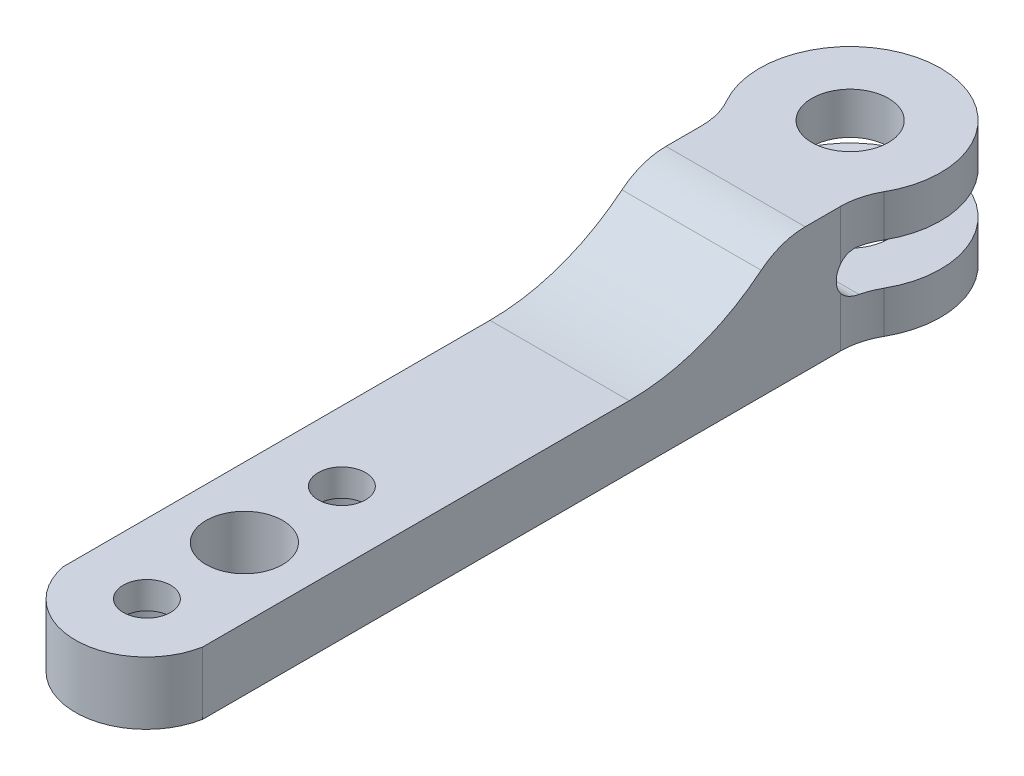
ISO-10303-21;
HEADER;
FILE_DESCRIPTION(('STEP AP214'),'2;1');
FILE_NAME('part.step','',(''),(''),'','','');
FILE_SCHEMA(('AUTOMOTIVE_DESIGN { 1 0 10303 214 1 1 1 1 }'));
ENDSEC;
DATA;
#1=APPLICATION_CONTEXT('core data for automotive mechanical design processes');
#2=APPLICATION_PROTOCOL_DEFINITION('international standard','automotive_design',2000,#1);
#3=PRODUCT_CONTEXT('',#1,'mechanical');
#4=PRODUCT('Part','Part','',(#3));
#5=PRODUCT_RELATED_PRODUCT_CATEGORY('part','',(#4));
#6=PRODUCT_DEFINITION_FORMATION('','',#4);
#7=PRODUCT_DEFINITION_CONTEXT('part definition',#1,'design');
#8=PRODUCT_DEFINITION('design','',#6,#7);
#9=PRODUCT_DEFINITION_SHAPE('','',#8);
#10=(LENGTH_UNIT() NAMED_UNIT(*) SI_UNIT(.MILLI.,.METRE.));
#11=(NAMED_UNIT(*) PLANE_ANGLE_UNIT() SI_UNIT($,.RADIAN.));
#12=(NAMED_UNIT(*) SI_UNIT($,.STERADIAN.) SOLID_ANGLE_UNIT());
#13=UNCERTAINTY_MEASURE_WITH_UNIT(LENGTH_MEASURE(1.E-05),#10,'distance_accuracy_value','');
#14=(GEOMETRIC_REPRESENTATION_CONTEXT(3) GLOBAL_UNCERTAINTY_ASSIGNED_CONTEXT((#13)) GLOBAL_UNIT_ASSIGNED_CONTEXT((#10,
#11,#12)) REPRESENTATION_CONTEXT('',''));
#15=CARTESIAN_POINT('',(0.,0.,0.));
#16=DIRECTION('',(0.,0.,1.));
#17=DIRECTION('',(1.,0.,0.));
#18=AXIS2_PLACEMENT_3D('',#15,#16,#17);
#19=CARTESIAN_POINT('',(0.,9.,-21.75));
#20=DIRECTION('',(0.,-1.,0.));
#21=DIRECTION('',(0.,0.,-1.));
#22=AXIS2_PLACEMENT_3D('',#19,#20,#21);
#23=CYLINDRICAL_SURFACE('',#22,6.5);
#24=CARTESIAN_POINT('',(0.,9.,-21.75));
#25=DIRECTION('',(0.,1.,0.));
#26=DIRECTION('',(0.,0.,1.));
#27=AXIS2_PLACEMENT_3D('',#24,#25,#26);
#28=CIRCLE('',#27,6.5);
#29=CARTESIAN_POINT('',(5.65217391304348,9.,-18.5401822393303));
#30=VERTEX_POINT('',#29);
#31=CARTESIAN_POINT('',(-5.65217391304348,9.,-18.5401822393303));
#32=VERTEX_POINT('',#31);
#33=EDGE_CURVE('E208',#30,#32,#28,.T.);
#34=ORIENTED_EDGE('',*,*,#33,.F.);
#35=DIRECTION('',(0.,-1.,0.));
#36=VECTOR('',#35,1.);
#37=CARTESIAN_POINT('',(5.65217391304348,9.,-18.5401822393303));
#38=LINE('',#37,#36);
#39=CARTESIAN_POINT('',(5.65217391304348,6.,-18.5401822393303));
#40=VERTEX_POINT('',#39);
#41=EDGE_CURVE('E284',#30,#40,#38,.T.);
#42=ORIENTED_EDGE('',*,*,#41,.T.);
#43=CARTESIAN_POINT('',(0.,6.,-21.75));
#44=DIRECTION('',(0.,-1.,0.));
#45=DIRECTION('',(0.,0.,-1.));
#46=AXIS2_PLACEMENT_3D('',#43,#44,#45);
#47=CIRCLE('',#46,6.5);
#48=CARTESIAN_POINT('',(-5.65217391304348,6.,-18.5401822393303));
#49=VERTEX_POINT('',#48);
#50=EDGE_CURVE('E357',#40,#49,#47,.F.);
#51=ORIENTED_EDGE('',*,*,#50,.T.);
#52=DIRECTION('',(0.,-1.,0.));
#53=VECTOR('',#52,1.);
#54=CARTESIAN_POINT('',(-5.65217391304348,9.,-18.5401822393303));
#55=LINE('',#54,#53);
#56=EDGE_CURVE('E281',#49,#32,#55,.F.);
#57=ORIENTED_EDGE('',*,*,#56,.T.);
#58=EDGE_LOOP('',(#34,#42,#51,#57));
#59=FACE_BOUND('',#58,.T.);
#60=ADVANCED_FACE('F53',(#59),#23,.T.);
#61=CARTESIAN_POINT('',(0.,9.,-21.75));
#62=DIRECTION('',(0.,-1.,0.));
#63=DIRECTION('',(0.,0.,-1.));
#64=AXIS2_PLACEMENT_3D('',#61,#62,#63);
#65=CYLINDRICAL_SURFACE('',#64,2.75);
#66=CARTESIAN_POINT('',(0.,9.,-21.75));
#67=DIRECTION('',(0.,-1.,0.));
#68=DIRECTION('',(0.,0.,-1.));
#69=AXIS2_PLACEMENT_3D('',#66,#67,#68);
#70=CIRCLE('',#69,2.75);
#71=CARTESIAN_POINT('',(0.,9.,-24.5));
#72=VERTEX_POINT('',#71);
#73=EDGE_CURVE('E199',#72,#72,#70,.T.);
#74=ORIENTED_EDGE('',*,*,#73,.F.);
#75=EDGE_LOOP('',(#74));
#76=FACE_BOUND('',#75,.T.);
#77=CARTESIAN_POINT('',(0.,6.,-21.75));
#78=DIRECTION('',(0.,-1.,0.));
#79=DIRECTION('',(0.,0.,-1.));
#80=AXIS2_PLACEMENT_3D('',#77,#78,#79);
#81=CIRCLE('',#80,2.75);
#82=CARTESIAN_POINT('',(0.,6.,-24.5));
#83=VERTEX_POINT('',#82);
#84=EDGE_CURVE('E403',#83,#83,#81,.T.);
#85=ORIENTED_EDGE('',*,*,#84,.T.);
#86=EDGE_LOOP('',(#85));
#87=FACE_BOUND('',#86,.T.);
#88=ADVANCED_FACE('F478',(#76,#87),#65,.F.);
#89=CARTESIAN_POINT('',(-5.,4.5,21.75));
#90=DIRECTION('',(1.,0.,0.));
#91=DIRECTION('',(0.,0.,-1.));
#92=AXIS2_PLACEMENT_3D('',#89,#90,#91);
#93=PLANE('',#92);
#94=CARTESIAN_POINT('',(-5.,19.5,-0.884545425726689));
#95=DIRECTION('',(1.,0.,0.));
#96=DIRECTION('',(0.,0.,-1.));
#97=AXIS2_PLACEMENT_3D('',#94,#95,#96);
#98=CIRCLE('',#97,15.);
#99=CARTESIAN_POINT('',(-5.,4.5,-0.884545425726687));
#100=VERTEX_POINT('',#99);
#101=CARTESIAN_POINT('',(-5.,7.875,-10.3639639205501));
#102=VERTEX_POINT('',#101);
#103=EDGE_CURVE('E241',#100,#102,#98,.T.);
#104=ORIENTED_EDGE('',*,*,#103,.T.);
#105=CARTESIAN_POINT('',(-5.,4.,-13.5237700854912));
#106=DIRECTION('',(1.,0.,0.));
#107=DIRECTION('',(0.,0.,-1.));
#108=AXIS2_PLACEMENT_3D('',#105,#106,#107);
#109=CIRCLE('',#108,5.);
#110=CARTESIAN_POINT('',(-5.,9.,-13.5237700854912));
#111=VERTEX_POINT('',#110);
#112=EDGE_CURVE('E271',#102,#111,#109,.F.);
#113=ORIENTED_EDGE('',*,*,#112,.T.);
#114=DIRECTION('',(0.,0.,1.));
#115=VECTOR('',#114,1.);
#116=CARTESIAN_POINT('',(-5.,9.,-17.596688068541));
#117=LINE('',#116,#115);
#118=CARTESIAN_POINT('',(-5.,9.,-16.0710916541997));
#119=VERTEX_POINT('',#118);
#120=EDGE_CURVE('E212',#119,#111,#117,.T.);
#121=ORIENTED_EDGE('',*,*,#120,.F.);
#122=DIRECTION('',(0.,1.,0.));
#123=VECTOR('',#122,1.);
#124=CARTESIAN_POINT('',(-5.,6.,-16.0710916541997));
#125=LINE('',#124,#123);
#126=CARTESIAN_POINT('',(-5.,5.42745625891599,-16.0710916541997));
#127=VERTEX_POINT('',#126);
#128=EDGE_CURVE('E263',#119,#127,#125,.F.);
#129=ORIENTED_EDGE('',*,*,#128,.T.);
#130=CARTESIAN_POINT('',(-5.,4.50000000000001,-17.25));
#131=DIRECTION('',(1.,0.,0.));
#132=DIRECTION('',(0.,0.,-1.));
#133=AXIS2_PLACEMENT_3D('',#130,#131,#132);
#134=CIRCLE('',#133,1.5);
#135=CARTESIAN_POINT('',(-5.,3.57254374108402,-16.0710916541997));
#136=VERTEX_POINT('',#135);
#137=EDGE_CURVE('E411',#136,#127,#134,.F.);
#138=ORIENTED_EDGE('',*,*,#137,.F.);
#139=DIRECTION('',(0.,1.,0.));
#140=VECTOR('',#139,1.);
#141=CARTESIAN_POINT('',(-5.,0.,-16.0710916541997));
#142=LINE('',#141,#140);
#143=CARTESIAN_POINT('',(-5.,0.,-16.0710916541997));
#144=VERTEX_POINT('',#143);
#145=EDGE_CURVE('E267',#136,#144,#142,.F.);
#146=ORIENTED_EDGE('',*,*,#145,.T.);
#147=DIRECTION('',(0.,0.,1.));
#148=VECTOR('',#147,1.);
#149=CARTESIAN_POINT('',(-5.,0.,21.75));
#150=LINE('',#149,#148);
#151=CARTESIAN_POINT('',(-5.,0.,29.75));
#152=VERTEX_POINT('',#151);
#153=EDGE_CURVE('E228',#144,#152,#150,.T.);
#154=ORIENTED_EDGE('',*,*,#153,.T.);
#155=DIRECTION('',(0.,-1.,0.));
#156=VECTOR('',#155,1.);
#157=CARTESIAN_POINT('',(-5.,20.2261972553421,29.75));
#158=LINE('',#157,#156);
#159=CARTESIAN_POINT('',(-5.,4.5,29.75));
#160=VERTEX_POINT('',#159);
#161=EDGE_CURVE('E186',#160,#152,#158,.T.);
#162=ORIENTED_EDGE('',*,*,#161,.F.);
#163=DIRECTION('',(0.,0.,1.));
#164=VECTOR('',#163,1.);
#165=CARTESIAN_POINT('',(-5.,4.5,21.75));
#166=LINE('',#165,#164);
#167=EDGE_CURVE('E176',#100,#160,#166,.T.);
#168=ORIENTED_EDGE('',*,*,#167,.F.);
#169=EDGE_LOOP('',(#104,#113,#121,#129,#138,#146,#154,#162,#168));
#170=FACE_BOUND('',#169,.T.);
#171=ADVANCED_FACE('F373',(#170),#93,.F.);
#172=CARTESIAN_POINT('',(5.,4.5,21.75));
#173=DIRECTION('',(-1.,0.,0.));
#174=DIRECTION('',(0.,0.,1.));
#175=AXIS2_PLACEMENT_3D('',#172,#173,#174);
#176=PLANE('',#175);
#177=DIRECTION('',(0.,0.,-1.));
#178=VECTOR('',#177,1.);
#179=CARTESIAN_POINT('',(5.,9.,-17.596688068541));
#180=LINE('',#179,#178);
#181=CARTESIAN_POINT('',(5.,9.,-13.5237700854912));
#182=VERTEX_POINT('',#181);
#183=CARTESIAN_POINT('',(5.,9.,-16.0710916541997));
#184=VERTEX_POINT('',#183);
#185=EDGE_CURVE('E216',#182,#184,#180,.T.);
#186=ORIENTED_EDGE('',*,*,#185,.F.);
#187=CARTESIAN_POINT('',(5.,4.,-13.5237700854912));
#188=DIRECTION('',(-1.,0.,0.));
#189=DIRECTION('',(0.,0.,1.));
#190=AXIS2_PLACEMENT_3D('',#187,#188,#189);
#191=CIRCLE('',#190,5.);
#192=CARTESIAN_POINT('',(5.,7.875,-10.3639639205501));
#193=VERTEX_POINT('',#192);
#194=EDGE_CURVE('E257',#182,#193,#191,.F.);
#195=ORIENTED_EDGE('',*,*,#194,.T.);
#196=CARTESIAN_POINT('',(5.,19.5,-0.884545425726687));
#197=DIRECTION('',(-1.,0.,0.));
#198=DIRECTION('',(0.,0.,1.));
#199=AXIS2_PLACEMENT_3D('',#196,#197,#198);
#200=CIRCLE('',#199,15.);
#201=CARTESIAN_POINT('',(5.,4.5,-0.884545425726687));
#202=VERTEX_POINT('',#201);
#203=EDGE_CURVE('E170',#193,#202,#200,.T.);
#204=ORIENTED_EDGE('',*,*,#203,.T.);
#205=DIRECTION('',(0.,0.,-1.));
#206=VECTOR('',#205,1.);
#207=CARTESIAN_POINT('',(5.,4.5,21.75));
#208=LINE('',#207,#206);
#209=CARTESIAN_POINT('',(5.,4.5,29.75));
#210=VERTEX_POINT('',#209);
#211=EDGE_CURVE('E161',#210,#202,#208,.T.);
#212=ORIENTED_EDGE('',*,*,#211,.F.);
#213=DIRECTION('',(0.,-1.,0.));
#214=VECTOR('',#213,1.);
#215=CARTESIAN_POINT('',(5.,20.2261972553421,29.75));
#216=LINE('',#215,#214);
#217=CARTESIAN_POINT('',(5.,0.,29.75));
#218=VERTEX_POINT('',#217);
#219=EDGE_CURVE('E167',#210,#218,#216,.T.);
#220=ORIENTED_EDGE('',*,*,#219,.T.);
#221=DIRECTION('',(0.,0.,-1.));
#222=VECTOR('',#221,1.);
#223=CARTESIAN_POINT('',(5.,0.,21.75));
#224=LINE('',#223,#222);
#225=CARTESIAN_POINT('',(5.,0.,-16.0710916541997));
#226=VERTEX_POINT('',#225);
#227=EDGE_CURVE('E233',#218,#226,#224,.T.);
#228=ORIENTED_EDGE('',*,*,#227,.T.);
#229=DIRECTION('',(0.,1.,0.));
#230=VECTOR('',#229,1.);
#231=CARTESIAN_POINT('',(5.,3.00000000000001,-16.0710916541997));
#232=LINE('',#231,#230);
#233=CARTESIAN_POINT('',(5.,3.57254374108401,-16.0710916541997));
#234=VERTEX_POINT('',#233);
#235=EDGE_CURVE('E254',#226,#234,#232,.T.);
#236=ORIENTED_EDGE('',*,*,#235,.T.);
#237=CARTESIAN_POINT('',(5.,4.50000000000001,-17.25));
#238=DIRECTION('',(-1.,0.,0.));
#239=DIRECTION('',(0.,0.,1.));
#240=AXIS2_PLACEMENT_3D('',#237,#238,#239);
#241=CIRCLE('',#240,1.5);
#242=CARTESIAN_POINT('',(5.,5.427456258916,-16.0710916541997));
#243=VERTEX_POINT('',#242);
#244=EDGE_CURVE('E383',#243,#234,#241,.F.);
#245=ORIENTED_EDGE('',*,*,#244,.F.);
#246=DIRECTION('',(0.,1.,0.));
#247=VECTOR('',#246,1.);
#248=CARTESIAN_POINT('',(5.,9.,-16.0710916541997));
#249=LINE('',#248,#247);
#250=EDGE_CURVE('E251',#243,#184,#249,.T.);
#251=ORIENTED_EDGE('',*,*,#250,.T.);
#252=EDGE_LOOP('',(#186,#195,#204,#212,#220,#228,#236,#245,#251));
#253=FACE_BOUND('',#252,.T.);
#254=ADVANCED_FACE('F164',(#253),#176,.F.);
#255=CARTESIAN_POINT('',(0.,4.5,-21.75));
#256=DIRECTION('',(0.,1.,0.));
#257=DIRECTION('',(0.,0.,1.));
#258=AXIS2_PLACEMENT_3D('',#255,#256,#257);
#259=PLANE('',#258);
#260=CARTESIAN_POINT('',(0.,4.5,14.75));
#261=DIRECTION('',(0.,1.,0.));
#262=DIRECTION('',(0.,0.,1.));
#263=AXIS2_PLACEMENT_3D('',#260,#261,#262);
#264=CIRCLE('',#263,1.7);
#265=CARTESIAN_POINT('',(0.,4.5,16.45));
#266=VERTEX_POINT('',#265);
#267=EDGE_CURVE('E436',#266,#266,#264,.T.);
#268=ORIENTED_EDGE('',*,*,#267,.F.);
#269=EDGE_LOOP('',(#268));
#270=FACE_BOUND('',#269,.T.);
#271=CARTESIAN_POINT('',(0.,4.5,28.75));
#272=DIRECTION('',(0.,1.,0.));
#273=DIRECTION('',(0.,0.,1.));
#274=AXIS2_PLACEMENT_3D('',#271,#272,#273);
#275=CIRCLE('',#274,1.7);
#276=CARTESIAN_POINT('',(0.,4.5,30.45));
#277=VERTEX_POINT('',#276);
#278=EDGE_CURVE('E195',#277,#277,#275,.T.);
#279=ORIENTED_EDGE('',*,*,#278,.F.);
#280=EDGE_LOOP('',(#279));
#281=FACE_BOUND('',#280,.T.);
#282=CARTESIAN_POINT('',(0.,4.5,21.75));
#283=DIRECTION('',(0.,1.,0.));
#284=DIRECTION('',(0.,0.,1.));
#285=AXIS2_PLACEMENT_3D('',#282,#283,#284);
#286=CIRCLE('',#285,2.75);
#287=CARTESIAN_POINT('',(0.,4.5,24.5));
#288=VERTEX_POINT('',#287);
#289=EDGE_CURVE('E220',#288,#288,#286,.T.);
#290=ORIENTED_EDGE('',*,*,#289,.F.);
#291=EDGE_LOOP('',(#290));
#292=FACE_BOUND('',#291,.T.);
#293=ORIENTED_EDGE('',*,*,#211,.T.);
#294=DIRECTION('',(-1.,0.,0.));
#295=VECTOR('',#294,1.);
#296=CARTESIAN_POINT('',(-5.,4.5,-0.884545425726689));
#297=LINE('',#296,#295);
#298=EDGE_CURVE('E175',#202,#100,#297,.T.);
#299=ORIENTED_EDGE('',*,*,#298,.T.);
#300=ORIENTED_EDGE('',*,*,#167,.T.);
#301=CARTESIAN_POINT('',(0.,4.5,28.797316835229));
#302=DIRECTION('',(0.,1.,0.));
#303=DIRECTION('',(0.,0.,1.));
#304=AXIS2_PLACEMENT_3D('',#301,#302,#303);
#305=CIRCLE('',#304,5.08995139588171);
#306=EDGE_CURVE('E179',#210,#160,#305,.F.);
#307=ORIENTED_EDGE('',*,*,#306,.F.);
#308=EDGE_LOOP('',(#293,#299,#300,#307));
#309=FACE_BOUND('',#308,.T.);
#310=ADVANCED_FACE('F180',(#270,#281,#292,#309),#259,.T.);
#311=CARTESIAN_POINT('',(0.,0.,-21.75));
#312=DIRECTION('',(0.,1.,0.));
#313=DIRECTION('',(0.,0.,1.));
#314=AXIS2_PLACEMENT_3D('',#311,#312,#313);
#315=PLANE('',#314);
#316=CARTESIAN_POINT('',(0.,0.,14.75));
#317=DIRECTION('',(0.,-1.,0.));
#318=DIRECTION('',(0.,0.,-1.));
#319=AXIS2_PLACEMENT_3D('',#316,#317,#318);
#320=CIRCLE('',#319,3.125);
#321=CARTESIAN_POINT('',(0.,0.,11.625));
#322=VERTEX_POINT('',#321);
#323=EDGE_CURVE('E424',#322,#322,#320,.T.);
#324=ORIENTED_EDGE('',*,*,#323,.F.);
#325=EDGE_LOOP('',(#324));
#326=FACE_BOUND('',#325,.T.);
#327=CARTESIAN_POINT('',(0.,0.,28.75));
#328=DIRECTION('',(0.,-1.,0.));
#329=DIRECTION('',(0.,0.,-1.));
#330=AXIS2_PLACEMENT_3D('',#327,#328,#329);
#331=CIRCLE('',#330,3.125);
#332=CARTESIAN_POINT('',(0.,0.,25.625));
#333=VERTEX_POINT('',#332);
#334=EDGE_CURVE('E440',#333,#333,#331,.T.);
#335=ORIENTED_EDGE('',*,*,#334,.F.);
#336=EDGE_LOOP('',(#335));
#337=FACE_BOUND('',#336,.T.);
#338=CARTESIAN_POINT('',(0.,0.,-21.75));
#339=DIRECTION('',(0.,-1.,0.));
#340=DIRECTION('',(0.,0.,-1.));
#341=AXIS2_PLACEMENT_3D('',#338,#339,#340);
#342=CIRCLE('',#341,2.75);
#343=CARTESIAN_POINT('',(0.,0.,-24.5));
#344=VERTEX_POINT('',#343);
#345=EDGE_CURVE('E204',#344,#344,#342,.T.);
#346=ORIENTED_EDGE('',*,*,#345,.F.);
#347=EDGE_LOOP('',(#346));
#348=FACE_BOUND('',#347,.T.);
#349=ORIENTED_EDGE('',*,*,#153,.F.);
#350=CARTESIAN_POINT('',(-10.,0.,-16.0710916541997));
#351=DIRECTION('',(0.,1.,0.));
#352=DIRECTION('',(0.,0.,1.));
#353=AXIS2_PLACEMENT_3D('',#350,#351,#352);
#354=CIRCLE('',#353,5.);
#355=CARTESIAN_POINT('',(-5.65217391304348,0.,-18.5401822393303));
#356=VERTEX_POINT('',#355);
#357=EDGE_CURVE('E332',#144,#356,#354,.T.);
#358=ORIENTED_EDGE('',*,*,#357,.T.);
#359=CARTESIAN_POINT('',(0.,0.,-21.75));
#360=DIRECTION('',(0.,1.,0.));
#361=DIRECTION('',(0.,0.,1.));
#362=AXIS2_PLACEMENT_3D('',#359,#360,#361);
#363=CIRCLE('',#362,6.5);
#364=CARTESIAN_POINT('',(5.65217391304348,0.,-18.5401822393303));
#365=VERTEX_POINT('',#364);
#366=EDGE_CURVE('E203',#365,#356,#363,.T.);
#367=ORIENTED_EDGE('',*,*,#366,.F.);
#368=CARTESIAN_POINT('',(10.,0.,-16.0710916541997));
#369=DIRECTION('',(0.,1.,0.));
#370=DIRECTION('',(0.,0.,1.));
#371=AXIS2_PLACEMENT_3D('',#368,#369,#370);
#372=CIRCLE('',#371,5.);
#373=EDGE_CURVE('E288',#365,#226,#372,.T.);
#374=ORIENTED_EDGE('',*,*,#373,.T.);
#375=ORIENTED_EDGE('',*,*,#227,.F.);
#376=CARTESIAN_POINT('',(0.,0.,28.797316835229));
#377=DIRECTION('',(0.,-1.,0.));
#378=DIRECTION('',(0.,0.,-1.));
#379=AXIS2_PLACEMENT_3D('',#376,#377,#378);
#380=CIRCLE('',#379,5.08995139588171);
#381=EDGE_CURVE('E190',#218,#152,#380,.T.);
#382=ORIENTED_EDGE('',*,*,#381,.T.);
#383=EDGE_LOOP('',(#349,#358,#367,#374,#375,#382));
#384=FACE_BOUND('',#383,.T.);
#385=CARTESIAN_POINT('',(0.,0.,21.75));
#386=DIRECTION('',(0.,1.,0.));
#387=DIRECTION('',(0.,0.,1.));
#388=AXIS2_PLACEMENT_3D('',#385,#386,#387);
#389=CIRCLE('',#388,2.75);
#390=CARTESIAN_POINT('',(0.,0.,24.5));
#391=VERTEX_POINT('',#390);
#392=EDGE_CURVE('E224',#391,#391,#389,.T.);
#393=ORIENTED_EDGE('',*,*,#392,.T.);
#394=EDGE_LOOP('',(#393));
#395=FACE_BOUND('',#394,.T.);
#396=ADVANCED_FACE('F408',(#326,#337,#348,#384,#395),#315,.F.);
#397=CARTESIAN_POINT('',(0.,0.,21.75));
#398=DIRECTION('',(0.,1.,0.));
#399=DIRECTION('',(0.,0.,1.));
#400=AXIS2_PLACEMENT_3D('',#397,#398,#399);
#401=CYLINDRICAL_SURFACE('',#400,2.75);
#402=ORIENTED_EDGE('',*,*,#392,.F.);
#403=EDGE_LOOP('',(#402));
#404=FACE_BOUND('',#403,.T.);
#405=ORIENTED_EDGE('',*,*,#289,.T.);
#406=EDGE_LOOP('',(#405));
#407=FACE_BOUND('',#406,.T.);
#408=ADVANCED_FACE('F465',(#404,#407),#401,.F.);
#409=CARTESIAN_POINT('',(0.,3.,-21.75));
#410=DIRECTION('',(0.,-1.,0.));
#411=DIRECTION('',(0.,0.,-1.));
#412=AXIS2_PLACEMENT_3D('',#409,#410,#411);
#413=CIRCLE('',#412,6.5);
#414=CARTESIAN_POINT('',(5.65217391304348,3.00000000000001,-18.5401822393303));
#415=VERTEX_POINT('',#414);
#416=CARTESIAN_POINT('',(-5.65217391304348,3.00000000000001,-18.5401822393303));
#417=VERTEX_POINT('',#416);
#418=EDGE_CURVE('E364',#415,#417,#413,.F.);
#419=ORIENTED_EDGE('',*,*,#418,.F.);
#420=DIRECTION('',(0.,-1.,0.));
#421=VECTOR('',#420,1.);
#422=CARTESIAN_POINT('',(5.65217391304348,9.,-18.5401822393303));
#423=LINE('',#422,#421);
#424=EDGE_CURVE('E277',#415,#365,#423,.T.);
#425=ORIENTED_EDGE('',*,*,#424,.T.);
#426=ORIENTED_EDGE('',*,*,#366,.T.);
#427=DIRECTION('',(0.,-1.,0.));
#428=VECTOR('',#427,1.);
#429=CARTESIAN_POINT('',(-5.65217391304348,9.,-18.5401822393303));
#430=LINE('',#429,#428);
#431=EDGE_CURVE('E274',#356,#417,#430,.F.);
#432=ORIENTED_EDGE('',*,*,#431,.T.);
#433=EDGE_LOOP('',(#419,#425,#426,#432));
#434=FACE_BOUND('',#433,.T.);
#435=ADVANCED_FACE('F399',(#434),#23,.T.);
#436=CARTESIAN_POINT('',(0.,9.,-21.75));
#437=DIRECTION('',(0.,1.,0.));
#438=DIRECTION('',(0.,0.,1.));
#439=AXIS2_PLACEMENT_3D('',#436,#437,#438);
#440=PLANE('',#439);
#441=ORIENTED_EDGE('',*,*,#73,.T.);
#442=EDGE_LOOP('',(#441));
#443=FACE_BOUND('',#442,.T.);
#444=ORIENTED_EDGE('',*,*,#120,.T.);
#445=DIRECTION('',(-1.,0.,0.));
#446=VECTOR('',#445,1.);
#447=CARTESIAN_POINT('',(5.,9.,-13.5237700854912));
#448=LINE('',#447,#446);
#449=EDGE_CURVE('E247',#111,#182,#448,.F.);
#450=ORIENTED_EDGE('',*,*,#449,.T.);
#451=ORIENTED_EDGE('',*,*,#185,.T.);
#452=CARTESIAN_POINT('',(10.,9.,-16.0710916541997));
#453=DIRECTION('',(0.,1.,0.));
#454=DIRECTION('',(0.,0.,1.));
#455=AXIS2_PLACEMENT_3D('',#452,#453,#454);
#456=CIRCLE('',#455,5.);
#457=EDGE_CURVE('E328',#184,#30,#456,.F.);
#458=ORIENTED_EDGE('',*,*,#457,.T.);
#459=ORIENTED_EDGE('',*,*,#33,.T.);
#460=CARTESIAN_POINT('',(-10.,9.,-16.0710916541997));
#461=DIRECTION('',(0.,1.,0.));
#462=DIRECTION('',(0.,0.,1.));
#463=AXIS2_PLACEMENT_3D('',#460,#461,#462);
#464=CIRCLE('',#463,5.);
#465=EDGE_CURVE('E13',#32,#119,#464,.F.);
#466=ORIENTED_EDGE('',*,*,#465,.T.);
#467=EDGE_LOOP('',(#444,#450,#451,#458,#459,#466));
#468=FACE_BOUND('',#467,.T.);
#469=ADVANCED_FACE('F370',(#443,#468),#440,.T.);
#470=CARTESIAN_POINT('',(0.,3.,-21.75));
#471=DIRECTION('',(0.,-1.,0.));
#472=DIRECTION('',(0.,0.,-1.));
#473=AXIS2_PLACEMENT_3D('',#470,#471,#472);
#474=CIRCLE('',#473,2.75);
#475=CARTESIAN_POINT('',(0.,3.,-24.5));
#476=VERTEX_POINT('',#475);
#477=EDGE_CURVE('E416',#476,#476,#474,.T.);
#478=ORIENTED_EDGE('',*,*,#477,.F.);
#479=EDGE_LOOP('',(#478));
#480=FACE_BOUND('',#479,.T.);
#481=ORIENTED_EDGE('',*,*,#345,.T.);
#482=EDGE_LOOP('',(#481));
#483=FACE_BOUND('',#482,.T.);
#484=ADVANCED_FACE('F484',(#480,#483),#65,.F.);
#485=CARTESIAN_POINT('',(0.,20.2261972553421,28.797316835229));
#486=DIRECTION('',(0.,-1.,0.));
#487=DIRECTION('',(0.,0.,-1.));
#488=AXIS2_PLACEMENT_3D('',#485,#486,#487);
#489=CYLINDRICAL_SURFACE('',#488,5.08995139588171);
#490=ORIENTED_EDGE('',*,*,#219,.F.);
#491=ORIENTED_EDGE('',*,*,#306,.T.);
#492=ORIENTED_EDGE('',*,*,#161,.T.);
#493=ORIENTED_EDGE('',*,*,#381,.F.);
#494=EDGE_LOOP('',(#490,#491,#492,#493));
#495=FACE_BOUND('',#494,.T.);
#496=ADVANCED_FACE('F188',(#495),#489,.T.);
#497=CARTESIAN_POINT('',(0.,0.,28.75));
#498=DIRECTION('',(0.,-1.,0.));
#499=DIRECTION('',(0.,0.,-1.));
#500=AXIS2_PLACEMENT_3D('',#497,#498,#499);
#501=CYLINDRICAL_SURFACE('',#500,1.7);
#502=CARTESIAN_POINT('',(0.,2.55,28.75));
#503=DIRECTION('',(0.,-1.,0.));
#504=DIRECTION('',(0.,0.,-1.));
#505=AXIS2_PLACEMENT_3D('',#502,#503,#504);
#506=CIRCLE('',#505,1.7);
#507=CARTESIAN_POINT('',(0.,2.55,27.05));
#508=VERTEX_POINT('',#507);
#509=EDGE_CURVE('E448',#508,#508,#506,.T.);
#510=ORIENTED_EDGE('',*,*,#509,.T.);
#511=EDGE_LOOP('',(#510));
#512=FACE_BOUND('',#511,.T.);
#513=ORIENTED_EDGE('',*,*,#278,.T.);
#514=EDGE_LOOP('',(#513));
#515=FACE_BOUND('',#514,.T.);
#516=ADVANCED_FACE('F457',(#512,#515),#501,.F.);
#517=CARTESIAN_POINT('',(1.69999999999992,2.55,28.75));
#518=DIRECTION('',(0.,1.,0.));
#519=DIRECTION('',(0.,0.,1.));
#520=AXIS2_PLACEMENT_3D('',#517,#518,#519);
#521=PLANE('',#520);
#522=ORIENTED_EDGE('',*,*,#509,.F.);
#523=EDGE_LOOP('',(#522));
#524=FACE_BOUND('',#523,.T.);
#525=CARTESIAN_POINT('',(0.,2.55,28.75));
#526=DIRECTION('',(0.,-1.,0.));
#527=DIRECTION('',(0.,0.,-1.));
#528=AXIS2_PLACEMENT_3D('',#525,#526,#527);
#529=CIRCLE('',#528,3.125);
#530=CARTESIAN_POINT('',(0.,2.55,25.625));
#531=VERTEX_POINT('',#530);
#532=EDGE_CURVE('E444',#531,#531,#529,.T.);
#533=ORIENTED_EDGE('',*,*,#532,.T.);
#534=EDGE_LOOP('',(#533));
#535=FACE_BOUND('',#534,.T.);
#536=ADVANCED_FACE('F495',(#524,#535),#521,.F.);
#537=CARTESIAN_POINT('',(0.,0.,28.75));
#538=DIRECTION('',(0.,-1.,0.));
#539=DIRECTION('',(0.,0.,-1.));
#540=AXIS2_PLACEMENT_3D('',#537,#538,#539);
#541=CYLINDRICAL_SURFACE('',#540,3.125);
#542=ORIENTED_EDGE('',*,*,#532,.F.);
#543=EDGE_LOOP('',(#542));
#544=FACE_BOUND('',#543,.T.);
#545=ORIENTED_EDGE('',*,*,#334,.T.);
#546=EDGE_LOOP('',(#545));
#547=FACE_BOUND('',#546,.T.);
#548=ADVANCED_FACE('F499',(#544,#547),#541,.F.);
#549=CARTESIAN_POINT('',(0.,0.,14.75));
#550=DIRECTION('',(0.,-1.,0.));
#551=DIRECTION('',(0.,0.,-1.));
#552=AXIS2_PLACEMENT_3D('',#549,#550,#551);
#553=CYLINDRICAL_SURFACE('',#552,1.7);
#554=CARTESIAN_POINT('',(0.,2.55,14.75));
#555=DIRECTION('',(0.,-1.,0.));
#556=DIRECTION('',(0.,0.,-1.));
#557=AXIS2_PLACEMENT_3D('',#554,#555,#556);
#558=CIRCLE('',#557,1.7);
#559=CARTESIAN_POINT('',(0.,2.55,13.05));
#560=VERTEX_POINT('',#559);
#561=EDGE_CURVE('E432',#560,#560,#558,.T.);
#562=ORIENTED_EDGE('',*,*,#561,.T.);
#563=EDGE_LOOP('',(#562));
#564=FACE_BOUND('',#563,.T.);
#565=ORIENTED_EDGE('',*,*,#267,.T.);
#566=EDGE_LOOP('',(#565));
#567=FACE_BOUND('',#566,.T.);
#568=ADVANCED_FACE('F503',(#564,#567),#553,.F.);
#569=CARTESIAN_POINT('',(1.69999999999992,2.55,14.75));
#570=DIRECTION('',(0.,1.,0.));
#571=DIRECTION('',(0.,0.,1.));
#572=AXIS2_PLACEMENT_3D('',#569,#570,#571);
#573=PLANE('',#572);
#574=ORIENTED_EDGE('',*,*,#561,.F.);
#575=EDGE_LOOP('',(#574));
#576=FACE_BOUND('',#575,.T.);
#577=CARTESIAN_POINT('',(0.,2.55,14.75));
#578=DIRECTION('',(0.,-1.,0.));
#579=DIRECTION('',(0.,0.,-1.));
#580=AXIS2_PLACEMENT_3D('',#577,#578,#579);
#581=CIRCLE('',#580,3.125);
#582=CARTESIAN_POINT('',(0.,2.55,11.625));
#583=VERTEX_POINT('',#582);
#584=EDGE_CURVE('E428',#583,#583,#581,.T.);
#585=ORIENTED_EDGE('',*,*,#584,.T.);
#586=EDGE_LOOP('',(#585));
#587=FACE_BOUND('',#586,.T.);
#588=ADVANCED_FACE('F507',(#576,#587),#573,.F.);
#589=CARTESIAN_POINT('',(0.,0.,14.75));
#590=DIRECTION('',(0.,-1.,0.));
#591=DIRECTION('',(0.,0.,-1.));
#592=AXIS2_PLACEMENT_3D('',#589,#590,#591);
#593=CYLINDRICAL_SURFACE('',#592,3.125);
#594=ORIENTED_EDGE('',*,*,#584,.F.);
#595=EDGE_LOOP('',(#594));
#596=FACE_BOUND('',#595,.T.);
#597=ORIENTED_EDGE('',*,*,#323,.T.);
#598=EDGE_LOOP('',(#597));
#599=FACE_BOUND('',#598,.T.);
#600=ADVANCED_FACE('F511',(#596,#599),#593,.F.);
#601=CARTESIAN_POINT('',(-5.,19.5,-0.884545425726689));
#602=DIRECTION('',(1.,0.,0.));
#603=DIRECTION('',(0.,0.,-1.));
#604=AXIS2_PLACEMENT_3D('',#601,#602,#603);
#605=CYLINDRICAL_SURFACE('',#604,15.);
#606=ORIENTED_EDGE('',*,*,#203,.F.);
#607=DIRECTION('',(1.,0.,0.));
#608=VECTOR('',#607,1.);
#609=CARTESIAN_POINT('',(-5.,7.875,-10.3639639205501));
#610=LINE('',#609,#608);
#611=EDGE_CURVE('E260',#193,#102,#610,.F.);
#612=ORIENTED_EDGE('',*,*,#611,.T.);
#613=ORIENTED_EDGE('',*,*,#103,.F.);
#614=ORIENTED_EDGE('',*,*,#298,.F.);
#615=EDGE_LOOP('',(#606,#612,#613,#614));
#616=FACE_BOUND('',#615,.T.);
#617=ADVANCED_FACE('F514',(#616),#605,.F.);
#618=CARTESIAN_POINT('',(6.501,4.50000000000001,-17.25));
#619=DIRECTION('',(-1.,0.,0.));
#620=DIRECTION('',(0.,0.,1.));
#621=AXIS2_PLACEMENT_3D('',#618,#619,#620);
#622=CYLINDRICAL_SURFACE('',#621,1.5);
#623=DIRECTION('',(-1.,0.,0.));
#624=VECTOR('',#623,1.);
#625=CARTESIAN_POINT('',(6.501,3.00000000000001,-17.25));
#626=LINE('',#625,#624);
#627=CARTESIAN_POINT('',(5.14096973540991,3.00000000000001,-17.25));
#628=VERTEX_POINT('',#627);
#629=CARTESIAN_POINT('',(-5.14096973540991,3.00000000000001,-17.25));
#630=VERTEX_POINT('',#629);
#631=EDGE_CURVE('E78',#628,#630,#626,.T.);
#632=ORIENTED_EDGE('',*,*,#631,.T.);
#633=CARTESIAN_POINT('',(-5.14096973540991,3.00000000000001,-17.25));
#634=CARTESIAN_POINT('',(-5.13122306678439,3.00000001386172,-17.2098382660384));
#635=CARTESIAN_POINT('',(-5.12198361804337,3.0016143443794,-17.1695701264278));
#636=CARTESIAN_POINT('',(-5.1045509155036,3.00811083393898,-17.0890660577459));
#637=CARTESIAN_POINT('',(-5.09635780134891,3.0129934286226,-17.0488301336848));
#638=CARTESIAN_POINT('',(-5.07343336435328,3.0325726931995,-16.9287328852529));
#639=CARTESIAN_POINT('',(-5.06031328486456,3.05220052938287,-16.8493011119247));
#640=CARTESIAN_POINT('',(-5.03834189802887,3.10440519427217,-16.6940855691921));
#641=CARTESIAN_POINT('',(-5.02949772433115,3.13700349808049,-16.6183080846378));
#642=CARTESIAN_POINT('',(-5.01563453791452,3.21436545668258,-16.4728790834753));
#643=CARTESIAN_POINT('',(-5.01061354601269,3.25912280068564,-16.4032244137543));
#644=CARTESIAN_POINT('',(-5.0044591258324,3.34738509322441,-16.2880218931303));
#645=CARTESIAN_POINT('',(-5.00267958527119,3.38858073624472,-16.2407153230366));
#646=CARTESIAN_POINT('',(-5.00044931069028,3.47654619852927,-16.1516042016396));
#647=CARTESIAN_POINT('',(-4.99999806542814,3.52331386598541,-16.1097975394183));
#648=CARTESIAN_POINT('',(-5.,3.57254374108402,-16.0710916541997));
#649=B_SPLINE_CURVE_WITH_KNOTS('',3,(#633,#634,#635,#636,#637,#638,#639,#640,#641,#642,#643,
#644,#645,#646,#647,#648),.UNSPECIFIED.,.F.,.F.,(4,2,2,2,2,2,2,4),(0.,0.123913326812101,
0.247843173881909,0.495151371668872,0.742870751041893,0.990461803816277,1.17824247779334,
1.36595086813449),.UNSPECIFIED.);
#650=EDGE_CURVE('E338',#630,#136,#649,.T.);
#651=ORIENTED_EDGE('',*,*,#650,.T.);
#652=ORIENTED_EDGE('',*,*,#137,.T.);
#653=CARTESIAN_POINT('',(-5.,5.42745625891599,-16.0710916541997));
#654=CARTESIAN_POINT('',(-5.00000074696193,5.4599522379571,-16.09665684897));
#655=CARTESIAN_POINT('',(-5.00019633863853,5.49137607111662,-16.123554607005));
#656=CARTESIAN_POINT('',(-5.00110332899378,5.55189580344553,-16.1798480136611));
#657=CARTESIAN_POINT('',(-5.00181476115676,5.58099155135765,-16.2092438243268));
#658=CARTESIAN_POINT('',(-5.00490796714583,5.6643964640286,-16.3008030136407));
#659=CARTESIAN_POINT('',(-5.00824767450605,5.71495146754392,-16.3664391946178));
#660=CARTESIAN_POINT('',(-5.01837915978824,5.80453657844196,-16.5050092923995));
#661=CARTESIAN_POINT('',(-5.02517602679329,5.84354956120018,-16.5779538399445));
#662=CARTESIAN_POINT('',(-5.04286866064635,5.90894090034146,-16.7288168140271));
#663=CARTESIAN_POINT('',(-5.05376184910424,5.93532718078771,-16.8067320862266));
#664=CARTESIAN_POINT('',(-5.07673476727107,5.97013472694995,-16.945818779125));
#665=CARTESIAN_POINT('',(-5.08788421894766,5.98136238825462,-17.0064623182054));
#666=CARTESIAN_POINT('',(-5.11261727684116,5.99630482721696,-17.1281639727999));
#667=CARTESIAN_POINT('',(-5.12620030010508,6.00002140151496,-17.1892219856657));
#668=CARTESIAN_POINT('',(-5.14096973540991,6.,-17.25));
#669=B_SPLINE_CURVE_WITH_KNOTS('',3,(#653,#654,#655,#656,#657,#658,#659,#660,#661,#662,#663,
#664,#665,#666,#667,#668),.UNSPECIFIED.,.F.,.F.,(4,2,2,2,2,2,2,4),(0.,0.123967005515838,
0.247942058723407,0.495408670530932,0.743240622335131,0.990916839107052,1.1784567995339,
1.36595189538236),.UNSPECIFIED.);
#670=CARTESIAN_POINT('',(-5.14096973540991,6.,-17.25));
#671=VERTEX_POINT('',#670);
#672=EDGE_CURVE('E345',#127,#671,#669,.T.);
#673=ORIENTED_EDGE('',*,*,#672,.T.);
#674=DIRECTION('',(-1.,0.,0.));
#675=VECTOR('',#674,1.);
#676=CARTESIAN_POINT('',(6.501,6.,-17.25));
#677=LINE('',#676,#675);
#678=CARTESIAN_POINT('',(5.14096973540991,6.,-17.25));
#679=VERTEX_POINT('',#678);
#680=EDGE_CURVE('E70',#679,#671,#677,.T.);
#681=ORIENTED_EDGE('',*,*,#680,.F.);
#682=CARTESIAN_POINT('',(5.14096973540991,6.,-17.25));
#683=CARTESIAN_POINT('',(5.13122306678439,5.99999998613829,-17.2098382660384));
#684=CARTESIAN_POINT('',(5.12198361804337,5.99838565562061,-17.1695701264278));
#685=CARTESIAN_POINT('',(5.1045509155036,5.99188916606103,-17.0890660577459));
#686=CARTESIAN_POINT('',(5.09635780134891,5.98700657137741,-17.0488301336848));
#687=CARTESIAN_POINT('',(5.07343336435329,5.96742730680052,-16.9287328852529));
#688=CARTESIAN_POINT('',(5.06031328486457,5.94779947061715,-16.8493011119247));
#689=CARTESIAN_POINT('',(5.03834189802888,5.89559480572784,-16.6940855691921));
#690=CARTESIAN_POINT('',(5.02949772433115,5.86299650191952,-16.6183080846378));
#691=CARTESIAN_POINT('',(5.01563453791452,5.78563454331743,-16.4728790834753));
#692=CARTESIAN_POINT('',(5.0106135460127,5.74087719931437,-16.4032244137543));
#693=CARTESIAN_POINT('',(5.0044591258324,5.6526149067756,-16.2880218931303));
#694=CARTESIAN_POINT('',(5.00267958527119,5.61141926375529,-16.2407153230365));
#695=CARTESIAN_POINT('',(5.00044931069029,5.52345380147074,-16.1516042016396));
#696=CARTESIAN_POINT('',(4.99999806542814,5.47668613401461,-16.1097975394183));
#697=CARTESIAN_POINT('',(5.,5.427456258916,-16.0710916541997));
#698=B_SPLINE_CURVE_WITH_KNOTS('',3,(#682,#683,#684,#685,#686,#687,#688,#689,#690,#691,#692,
#693,#694,#695,#696,#697),.UNSPECIFIED.,.F.,.F.,(4,2,2,2,2,2,2,4),(0.,0.123913326812101,
0.247843173881912,0.495151371668875,0.7428707510419,0.990461803816285,1.17824247779334,
1.36595086813448),.UNSPECIFIED.);
#699=EDGE_CURVE('E321',#679,#243,#698,.T.);
#700=ORIENTED_EDGE('',*,*,#699,.T.);
#701=ORIENTED_EDGE('',*,*,#244,.T.);
#702=CARTESIAN_POINT('',(5.,3.57254374108401,-16.0710916541997));
#703=CARTESIAN_POINT('',(5.00000074696194,3.54004776204291,-16.09665684897));
#704=CARTESIAN_POINT('',(5.00019633863854,3.50862392888339,-16.1235546070051));
#705=CARTESIAN_POINT('',(5.00110332899378,3.44810419655447,-16.1798480136611));
#706=CARTESIAN_POINT('',(5.00181476115677,3.41900844864236,-16.2092438243269));
#707=CARTESIAN_POINT('',(5.00490796714584,3.33560353597141,-16.3008030136407));
#708=CARTESIAN_POINT('',(5.00824767450606,3.28504853245609,-16.3664391946178));
#709=CARTESIAN_POINT('',(5.01837915978825,3.19546342155805,-16.5050092923995));
#710=CARTESIAN_POINT('',(5.0251760267933,3.15645043879983,-16.5779538399445));
#711=CARTESIAN_POINT('',(5.04286866064636,3.09105909965855,-16.7288168140271));
#712=CARTESIAN_POINT('',(5.05376184910425,3.0646728192123,-16.8067320862266));
#713=CARTESIAN_POINT('',(5.07673476727108,3.02986527305006,-16.945818779125));
#714=CARTESIAN_POINT('',(5.08788421894766,3.0186376117454,-17.0064623182054));
#715=CARTESIAN_POINT('',(5.11261727684116,3.00369517278305,-17.1281639727999));
#716=CARTESIAN_POINT('',(5.12620030010508,2.99997859848505,-17.1892219856657));
#717=CARTESIAN_POINT('',(5.14096973540991,3.00000000000001,-17.25));
#718=B_SPLINE_CURVE_WITH_KNOTS('',3,(#702,#703,#704,#705,#706,#707,#708,#709,#710,#711,#712,
#713,#714,#715,#716,#717),.UNSPECIFIED.,.F.,.F.,(4,2,2,2,2,2,2,4),(0.,0.12396700551584,
0.24794205872341,0.495408670530932,0.743240622335128,0.990916839107052,1.17845679953389,
1.36595189538235),.UNSPECIFIED.);
#719=EDGE_CURVE('E291',#234,#628,#718,.T.);
#720=ORIENTED_EDGE('',*,*,#719,.T.);
#721=EDGE_LOOP('',(#632,#651,#652,#673,#681,#700,#701,#720));
#722=FACE_BOUND('',#721,.T.);
#723=ADVANCED_FACE('F302',(#722),#622,.F.);
#724=CARTESIAN_POINT('',(6.501,3.,-28.25));
#725=DIRECTION('',(0.,-1.,0.));
#726=DIRECTION('',(0.,0.,-1.));
#727=AXIS2_PLACEMENT_3D('',#724,#725,#726);
#728=PLANE('',#727);
#729=ORIENTED_EDGE('',*,*,#418,.T.);
#730=CARTESIAN_POINT('',(-10.,3.00000000000001,-16.0710916541997));
#731=DIRECTION('',(0.,-1.,0.));
#732=DIRECTION('',(0.,0.,-1.));
#733=AXIS2_PLACEMENT_3D('',#730,#731,#732);
#734=CIRCLE('',#733,5.);
#735=EDGE_CURVE('E335',#417,#630,#734,.T.);
#736=ORIENTED_EDGE('',*,*,#735,.T.);
#737=ORIENTED_EDGE('',*,*,#631,.F.);
#738=CARTESIAN_POINT('',(10.,3.00000000000001,-16.0710916541997));
#739=DIRECTION('',(0.,-1.,0.));
#740=DIRECTION('',(0.,0.,-1.));
#741=AXIS2_PLACEMENT_3D('',#738,#739,#740);
#742=CIRCLE('',#741,5.);
#743=EDGE_CURVE('E300',#628,#415,#742,.T.);
#744=ORIENTED_EDGE('',*,*,#743,.T.);
#745=EDGE_LOOP('',(#729,#736,#737,#744));
#746=FACE_BOUND('',#745,.T.);
#747=ORIENTED_EDGE('',*,*,#477,.T.);
#748=EDGE_LOOP('',(#747));
#749=FACE_BOUND('',#748,.T.);
#750=ADVANCED_FACE('F393',(#746,#749),#728,.F.);
#751=CARTESIAN_POINT('',(6.501,6.,-28.25));
#752=DIRECTION('',(0.,-1.,0.));
#753=DIRECTION('',(0.,0.,-1.));
#754=AXIS2_PLACEMENT_3D('',#751,#752,#753);
#755=PLANE('',#754);
#756=ORIENTED_EDGE('',*,*,#84,.F.);
#757=EDGE_LOOP('',(#756));
#758=FACE_BOUND('',#757,.T.);
#759=ORIENTED_EDGE('',*,*,#50,.F.);
#760=CARTESIAN_POINT('',(10.,6.,-16.0710916541997));
#761=DIRECTION('',(0.,-1.,0.));
#762=DIRECTION('',(0.,0.,-1.));
#763=AXIS2_PLACEMENT_3D('',#760,#761,#762);
#764=CIRCLE('',#763,5.);
#765=EDGE_CURVE('E329',#40,#679,#764,.F.);
#766=ORIENTED_EDGE('',*,*,#765,.T.);
#767=ORIENTED_EDGE('',*,*,#680,.T.);
#768=CARTESIAN_POINT('',(-10.,6.,-16.0710916541997));
#769=DIRECTION('',(0.,-1.,0.));
#770=DIRECTION('',(0.,0.,-1.));
#771=AXIS2_PLACEMENT_3D('',#768,#769,#770);
#772=CIRCLE('',#771,5.);
#773=EDGE_CURVE('E63',#671,#49,#772,.F.);
#774=ORIENTED_EDGE('',*,*,#773,.T.);
#775=EDGE_LOOP('',(#759,#766,#767,#774));
#776=FACE_BOUND('',#775,.T.);
#777=ADVANCED_FACE('F356',(#758,#776),#755,.T.);
#778=CARTESIAN_POINT('',(-5.,4.,-13.5237700854912));
#779=DIRECTION('',(1.,0.,0.));
#780=DIRECTION('',(0.,0.,-1.));
#781=AXIS2_PLACEMENT_3D('',#778,#779,#780);
#782=CYLINDRICAL_SURFACE('',#781,5.);
#783=ORIENTED_EDGE('',*,*,#112,.F.);
#784=ORIENTED_EDGE('',*,*,#611,.F.);
#785=ORIENTED_EDGE('',*,*,#194,.F.);
#786=ORIENTED_EDGE('',*,*,#449,.F.);
#787=EDGE_LOOP('',(#783,#784,#785,#786));
#788=FACE_BOUND('',#787,.T.);
#789=ADVANCED_FACE('F312',(#788),#782,.T.);
#790=CARTESIAN_POINT('',(10.,9.,-16.0710916541997));
#791=DIRECTION('',(0.,-1.,0.));
#792=DIRECTION('',(0.,0.,-1.));
#793=AXIS2_PLACEMENT_3D('',#790,#791,#792);
#794=CYLINDRICAL_SURFACE('',#793,5.);
#795=ORIENTED_EDGE('',*,*,#719,.F.);
#796=ORIENTED_EDGE('',*,*,#235,.F.);
#797=ORIENTED_EDGE('',*,*,#373,.F.);
#798=ORIENTED_EDGE('',*,*,#424,.F.);
#799=ORIENTED_EDGE('',*,*,#743,.F.);
#800=EDGE_LOOP('',(#795,#796,#797,#798,#799));
#801=FACE_BOUND('',#800,.T.);
#802=ADVANCED_FACE('F306',(#801),#794,.F.);
#803=CARTESIAN_POINT('',(10.,9.,-16.0710916541997));
#804=DIRECTION('',(0.,-1.,0.));
#805=DIRECTION('',(0.,0.,-1.));
#806=AXIS2_PLACEMENT_3D('',#803,#804,#805);
#807=CYLINDRICAL_SURFACE('',#806,5.);
#808=ORIENTED_EDGE('',*,*,#457,.F.);
#809=ORIENTED_EDGE('',*,*,#250,.F.);
#810=ORIENTED_EDGE('',*,*,#699,.F.);
#811=ORIENTED_EDGE('',*,*,#765,.F.);
#812=ORIENTED_EDGE('',*,*,#41,.F.);
#813=EDGE_LOOP('',(#808,#809,#810,#811,#812));
#814=FACE_BOUND('',#813,.T.);
#815=ADVANCED_FACE('F311',(#814),#807,.F.);
#816=CARTESIAN_POINT('',(-10.,9.,-16.0710916541997));
#817=DIRECTION('',(0.,-1.,0.));
#818=DIRECTION('',(0.,0.,-1.));
#819=AXIS2_PLACEMENT_3D('',#816,#817,#818);
#820=CYLINDRICAL_SURFACE('',#819,5.);
#821=ORIENTED_EDGE('',*,*,#735,.F.);
#822=ORIENTED_EDGE('',*,*,#431,.F.);
#823=ORIENTED_EDGE('',*,*,#357,.F.);
#824=ORIENTED_EDGE('',*,*,#145,.F.);
#825=ORIENTED_EDGE('',*,*,#650,.F.);
#826=EDGE_LOOP('',(#821,#822,#823,#824,#825));
#827=FACE_BOUND('',#826,.T.);
#828=ADVANCED_FACE('F317',(#827),#820,.F.);
#829=CARTESIAN_POINT('',(-10.,9.,-16.0710916541997));
#830=DIRECTION('',(0.,-1.,0.));
#831=DIRECTION('',(0.,0.,-1.));
#832=AXIS2_PLACEMENT_3D('',#829,#830,#831);
#833=CYLINDRICAL_SURFACE('',#832,5.);
#834=ORIENTED_EDGE('',*,*,#465,.F.);
#835=ORIENTED_EDGE('',*,*,#56,.F.);
#836=ORIENTED_EDGE('',*,*,#773,.F.);
#837=ORIENTED_EDGE('',*,*,#672,.F.);
#838=ORIENTED_EDGE('',*,*,#128,.F.);
#839=EDGE_LOOP('',(#834,#835,#836,#837,#838));
#840=FACE_BOUND('',#839,.T.);
#841=ADVANCED_FACE('F55',(#840),#833,.F.);
#842=CLOSED_SHELL('',(#60,#88,#171,#254,#310,#396,#408,#435,#469,#484,#496,#516,#536,#548,#568,
#588,#600,#617,#723,#750,#777,#789,#802,#815,#828,#841));
#843=MANIFOLD_SOLID_BREP('B2',#842);
#844=ADVANCED_BREP_SHAPE_REPRESENTATION('',(#18,#843),#14);
#845=SHAPE_DEFINITION_REPRESENTATION(#9,#844);
ENDSEC;
END-ISO-10303-21;
